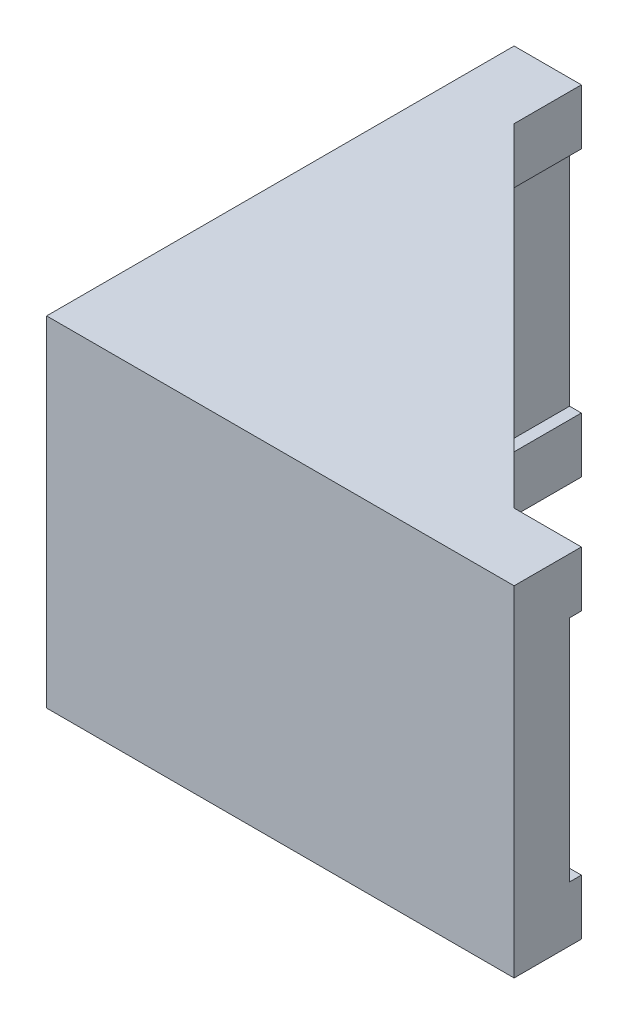
ISO-10303-21;
HEADER;
FILE_DESCRIPTION(('STEP AP214'),'2;1');
FILE_NAME('part.step','',(''),(''),'','','');
FILE_SCHEMA(('AUTOMOTIVE_DESIGN { 1 0 10303 214 1 1 1 1 }'));
ENDSEC;
DATA;
#1=APPLICATION_CONTEXT('core data for automotive mechanical design processes');
#2=APPLICATION_PROTOCOL_DEFINITION('international standard','automotive_design',2000,#1);
#3=PRODUCT_CONTEXT('',#1,'mechanical');
#4=PRODUCT('Part','Part','',(#3));
#5=PRODUCT_RELATED_PRODUCT_CATEGORY('part','',(#4));
#6=PRODUCT_DEFINITION_FORMATION('','',#4);
#7=PRODUCT_DEFINITION_CONTEXT('part definition',#1,'design');
#8=PRODUCT_DEFINITION('design','',#6,#7);
#9=PRODUCT_DEFINITION_SHAPE('','',#8);
#10=(LENGTH_UNIT() NAMED_UNIT(*) SI_UNIT(.MILLI.,.METRE.));
#11=(NAMED_UNIT(*) PLANE_ANGLE_UNIT() SI_UNIT($,.RADIAN.));
#12=(NAMED_UNIT(*) SI_UNIT($,.STERADIAN.) SOLID_ANGLE_UNIT());
#13=UNCERTAINTY_MEASURE_WITH_UNIT(LENGTH_MEASURE(1.E-05),#10,'distance_accuracy_value','');
#14=(GEOMETRIC_REPRESENTATION_CONTEXT(3) GLOBAL_UNCERTAINTY_ASSIGNED_CONTEXT((#13)) GLOBAL_UNIT_ASSIGNED_CONTEXT((#10,
#11,#12)) REPRESENTATION_CONTEXT('',''));
#15=CARTESIAN_POINT('',(0.,0.,0.));
#16=DIRECTION('',(0.,0.,1.));
#17=DIRECTION('',(1.,0.,0.));
#18=AXIS2_PLACEMENT_3D('',#15,#16,#17);
#19=CARTESIAN_POINT('',(0.,0.,0.));
#20=DIRECTION('',(0.,1.,0.));
#21=DIRECTION('',(0.,0.,1.));
#22=AXIS2_PLACEMENT_3D('',#19,#20,#21);
#23=PLANE('',#22);
#24=DIRECTION('',(1.,0.,0.));
#25=VECTOR('',#24,1.);
#26=CARTESIAN_POINT('',(3.3,0.,-3.3));
#27=LINE('',#26,#25);
#28=CARTESIAN_POINT('',(3.3,0.,-3.3));
#29=VERTEX_POINT('',#28);
#30=CARTESIAN_POINT('',(27.8,0.,-3.3));
#31=VERTEX_POINT('',#30);
#32=EDGE_CURVE('E197',#29,#31,#27,.T.);
#33=ORIENTED_EDGE('',*,*,#32,.F.);
#34=DIRECTION('',(0.,0.,1.));
#35=VECTOR('',#34,1.);
#36=CARTESIAN_POINT('',(3.3,0.,-3.3));
#37=LINE('',#36,#35);
#38=CARTESIAN_POINT('',(3.3,0.,-27.8));
#39=VERTEX_POINT('',#38);
#40=EDGE_CURVE('E58',#39,#29,#37,.T.);
#41=ORIENTED_EDGE('',*,*,#40,.F.);
#42=DIRECTION('',(-1.,0.,0.));
#43=VECTOR('',#42,1.);
#44=CARTESIAN_POINT('',(4.,0.,-27.8));
#45=LINE('',#44,#43);
#46=CARTESIAN_POINT('',(4.,0.,-27.8));
#47=VERTEX_POINT('',#46);
#48=EDGE_CURVE('E215',#47,#39,#45,.T.);
#49=ORIENTED_EDGE('',*,*,#48,.F.);
#50=DIRECTION('',(0.,0.,-1.));
#51=VECTOR('',#50,1.);
#52=CARTESIAN_POINT('',(4.,0.,-27.8));
#53=LINE('',#52,#51);
#54=CARTESIAN_POINT('',(4.,0.,-23.8));
#55=VERTEX_POINT('',#54);
#56=EDGE_CURVE('E232',#55,#47,#53,.T.);
#57=ORIENTED_EDGE('',*,*,#56,.F.);
#58=DIRECTION('',(-0.707106781186547,0.,-0.707106781186548));
#59=VECTOR('',#58,1.);
#60=CARTESIAN_POINT('',(4.,0.,-23.8));
#61=LINE('',#60,#59);
#62=CARTESIAN_POINT('',(23.8,0.,-4.));
#63=VERTEX_POINT('',#62);
#64=EDGE_CURVE('E230',#63,#55,#61,.T.);
#65=ORIENTED_EDGE('',*,*,#64,.F.);
#66=DIRECTION('',(-1.,0.,0.));
#67=VECTOR('',#66,1.);
#68=CARTESIAN_POINT('',(23.8,0.,-4.));
#69=LINE('',#68,#67);
#70=CARTESIAN_POINT('',(27.8,0.,-4.));
#71=VERTEX_POINT('',#70);
#72=EDGE_CURVE('E228',#71,#63,#69,.T.);
#73=ORIENTED_EDGE('',*,*,#72,.F.);
#74=DIRECTION('',(0.,0.,-1.));
#75=VECTOR('',#74,1.);
#76=CARTESIAN_POINT('',(27.8,0.,0.));
#77=LINE('',#76,#75);
#78=EDGE_CURVE('E52',#31,#71,#77,.T.);
#79=ORIENTED_EDGE('',*,*,#78,.F.);
#80=EDGE_LOOP('',(#33,#41,#49,#57,#65,#73,#79));
#81=FACE_BOUND('',#80,.T.);
#82=ADVANCED_FACE('F37',(#81),#23,.F.);
#83=CARTESIAN_POINT('',(0.,3.3,-27.8));
#84=DIRECTION('',(1.,0.,0.));
#85=DIRECTION('',(0.,0.,-1.));
#86=AXIS2_PLACEMENT_3D('',#83,#84,#85);
#87=PLANE('',#86);
#88=DIRECTION('',(0.,-1.,0.));
#89=VECTOR('',#88,1.);
#90=CARTESIAN_POINT('',(0.,3.3,-27.8));
#91=LINE('',#90,#89);
#92=CARTESIAN_POINT('',(0.,3.3,-27.8));
#93=VERTEX_POINT('',#92);
#94=CARTESIAN_POINT('',(0.,-16.9,-27.8));
#95=VERTEX_POINT('',#94);
#96=EDGE_CURVE('E226',#93,#95,#91,.T.);
#97=ORIENTED_EDGE('',*,*,#96,.T.);
#98=DIRECTION('',(0.,0.,-1.));
#99=VECTOR('',#98,1.);
#100=CARTESIAN_POINT('',(0.,-16.9,0.));
#101=LINE('',#100,#99);
#102=CARTESIAN_POINT('',(0.,-16.9,0.));
#103=VERTEX_POINT('',#102);
#104=EDGE_CURVE('E160',#103,#95,#101,.T.);
#105=ORIENTED_EDGE('',*,*,#104,.F.);
#106=DIRECTION('',(0.,-1.,0.));
#107=VECTOR('',#106,1.);
#108=CARTESIAN_POINT('',(0.,3.3,0.));
#109=LINE('',#108,#107);
#110=CARTESIAN_POINT('',(0.,3.3,0.));
#111=VERTEX_POINT('',#110);
#112=EDGE_CURVE('E11',#111,#103,#109,.T.);
#113=ORIENTED_EDGE('',*,*,#112,.F.);
#114=DIRECTION('',(0.,0.,1.));
#115=VECTOR('',#114,1.);
#116=CARTESIAN_POINT('',(0.,3.3,-27.8));
#117=LINE('',#116,#115);
#118=EDGE_CURVE('E211',#93,#111,#117,.T.);
#119=ORIENTED_EDGE('',*,*,#118,.F.);
#120=EDGE_LOOP('',(#97,#105,#113,#119));
#121=FACE_BOUND('',#120,.T.);
#122=ADVANCED_FACE('F39',(#121),#87,.F.);
#123=CARTESIAN_POINT('',(0.,3.3,0.));
#124=DIRECTION('',(0.,0.,-1.));
#125=DIRECTION('',(-1.,0.,0.));
#126=AXIS2_PLACEMENT_3D('',#123,#124,#125);
#127=PLANE('',#126);
#128=ORIENTED_EDGE('',*,*,#112,.T.);
#129=DIRECTION('',(-1.,0.,0.));
#130=VECTOR('',#129,1.);
#131=CARTESIAN_POINT('',(27.8,-16.9,0.));
#132=LINE('',#131,#130);
#133=CARTESIAN_POINT('',(27.8,-16.9,0.));
#134=VERTEX_POINT('',#133);
#135=EDGE_CURVE('E151',#134,#103,#132,.T.);
#136=ORIENTED_EDGE('',*,*,#135,.F.);
#137=DIRECTION('',(0.,-1.,0.));
#138=VECTOR('',#137,1.);
#139=CARTESIAN_POINT('',(27.8,3.3,0.));
#140=LINE('',#139,#138);
#141=CARTESIAN_POINT('',(27.8,3.3,0.));
#142=VERTEX_POINT('',#141);
#143=EDGE_CURVE('E45',#142,#134,#140,.T.);
#144=ORIENTED_EDGE('',*,*,#143,.F.);
#145=DIRECTION('',(1.,0.,0.));
#146=VECTOR('',#145,1.);
#147=CARTESIAN_POINT('',(0.,3.3,0.));
#148=LINE('',#147,#146);
#149=EDGE_CURVE('E214',#111,#142,#148,.T.);
#150=ORIENTED_EDGE('',*,*,#149,.F.);
#151=EDGE_LOOP('',(#128,#136,#144,#150));
#152=FACE_BOUND('',#151,.T.);
#153=ADVANCED_FACE('F158',(#152),#127,.F.);
#154=CARTESIAN_POINT('',(27.8,3.3,0.));
#155=DIRECTION('',(-1.,0.,0.));
#156=DIRECTION('',(0.,0.,1.));
#157=AXIS2_PLACEMENT_3D('',#154,#155,#156);
#158=PLANE('',#157);
#159=ORIENTED_EDGE('',*,*,#143,.T.);
#160=DIRECTION('',(0.,0.,1.));
#161=VECTOR('',#160,1.);
#162=CARTESIAN_POINT('',(27.8,-16.9,-3.3));
#163=LINE('',#162,#161);
#164=CARTESIAN_POINT('',(27.8,-16.9,-4.));
#165=VERTEX_POINT('',#164);
#166=EDGE_CURVE('E141',#165,#134,#163,.T.);
#167=ORIENTED_EDGE('',*,*,#166,.F.);
#168=DIRECTION('',(0.,1.,0.));
#169=VECTOR('',#168,1.);
#170=CARTESIAN_POINT('',(27.8,-16.9,-4.));
#171=LINE('',#170,#169);
#172=CARTESIAN_POINT('',(27.8,-13.6,-4.));
#173=VERTEX_POINT('',#172);
#174=EDGE_CURVE('E171',#165,#173,#171,.T.);
#175=ORIENTED_EDGE('',*,*,#174,.T.);
#176=DIRECTION('',(0.,0.,1.));
#177=VECTOR('',#176,1.);
#178=CARTESIAN_POINT('',(27.8,-13.6,-3.3));
#179=LINE('',#178,#177);
#180=CARTESIAN_POINT('',(27.8,-13.6,-3.3));
#181=VERTEX_POINT('',#180);
#182=EDGE_CURVE('E172',#173,#181,#179,.T.);
#183=ORIENTED_EDGE('',*,*,#182,.T.);
#184=DIRECTION('',(0.,1.,0.));
#185=VECTOR('',#184,1.);
#186=CARTESIAN_POINT('',(27.8,-13.6,-3.3));
#187=LINE('',#186,#185);
#188=EDGE_CURVE('E200',#181,#31,#187,.T.);
#189=ORIENTED_EDGE('',*,*,#188,.T.);
#190=ORIENTED_EDGE('',*,*,#78,.T.);
#191=DIRECTION('',(0.,-1.,0.));
#192=VECTOR('',#191,1.);
#193=CARTESIAN_POINT('',(27.8,3.3,-4.));
#194=LINE('',#193,#192);
#195=CARTESIAN_POINT('',(27.8,3.3,-4.));
#196=VERTEX_POINT('',#195);
#197=EDGE_CURVE('E146',#196,#71,#194,.T.);
#198=ORIENTED_EDGE('',*,*,#197,.F.);
#199=DIRECTION('',(0.,0.,-1.));
#200=VECTOR('',#199,1.);
#201=CARTESIAN_POINT('',(27.8,3.3,0.));
#202=LINE('',#201,#200);
#203=EDGE_CURVE('E143',#142,#196,#202,.T.);
#204=ORIENTED_EDGE('',*,*,#203,.F.);
#205=EDGE_LOOP('',(#159,#167,#175,#183,#189,#190,#198,#204));
#206=FACE_BOUND('',#205,.T.);
#207=ADVANCED_FACE('F139',(#206),#158,.F.);
#208=CARTESIAN_POINT('',(23.8,3.3,-4.));
#209=DIRECTION('',(0.,0.,1.));
#210=DIRECTION('',(1.,0.,0.));
#211=AXIS2_PLACEMENT_3D('',#208,#209,#210);
#212=PLANE('',#211);
#213=ORIENTED_EDGE('',*,*,#72,.T.);
#214=DIRECTION('',(0.,-1.,0.));
#215=VECTOR('',#214,1.);
#216=CARTESIAN_POINT('',(23.8,3.3,-4.));
#217=LINE('',#216,#215);
#218=CARTESIAN_POINT('',(23.8,3.3,-4.));
#219=VERTEX_POINT('',#218);
#220=EDGE_CURVE('E242',#219,#63,#217,.T.);
#221=ORIENTED_EDGE('',*,*,#220,.F.);
#222=DIRECTION('',(-1.,0.,0.));
#223=VECTOR('',#222,1.);
#224=CARTESIAN_POINT('',(23.8,3.3,-4.));
#225=LINE('',#224,#223);
#226=EDGE_CURVE('E218',#196,#219,#225,.T.);
#227=ORIENTED_EDGE('',*,*,#226,.F.);
#228=ORIENTED_EDGE('',*,*,#197,.T.);
#229=EDGE_LOOP('',(#213,#221,#227,#228));
#230=FACE_BOUND('',#229,.T.);
#231=ADVANCED_FACE('F248',(#230),#212,.F.);
#232=CARTESIAN_POINT('',(4.,3.3,-23.8));
#233=DIRECTION('',(-0.707106781186548,0.,0.707106781186547));
#234=DIRECTION('',(0.707106781186547,0.,0.707106781186548));
#235=AXIS2_PLACEMENT_3D('',#232,#233,#234);
#236=PLANE('',#235);
#237=ORIENTED_EDGE('',*,*,#64,.T.);
#238=DIRECTION('',(0.,-1.,0.));
#239=VECTOR('',#238,1.);
#240=CARTESIAN_POINT('',(4.,3.3,-23.8));
#241=LINE('',#240,#239);
#242=CARTESIAN_POINT('',(4.,3.3,-23.8));
#243=VERTEX_POINT('',#242);
#244=EDGE_CURVE('E239',#243,#55,#241,.T.);
#245=ORIENTED_EDGE('',*,*,#244,.F.);
#246=DIRECTION('',(-0.707106781186547,0.,-0.707106781186548));
#247=VECTOR('',#246,1.);
#248=CARTESIAN_POINT('',(4.,3.3,-23.8));
#249=LINE('',#248,#247);
#250=EDGE_CURVE('E220',#219,#243,#249,.T.);
#251=ORIENTED_EDGE('',*,*,#250,.F.);
#252=ORIENTED_EDGE('',*,*,#220,.T.);
#253=EDGE_LOOP('',(#237,#245,#251,#252));
#254=FACE_BOUND('',#253,.T.);
#255=ADVANCED_FACE('F254',(#254),#236,.F.);
#256=CARTESIAN_POINT('',(4.,3.3,-27.8));
#257=DIRECTION('',(-1.,0.,0.));
#258=DIRECTION('',(0.,0.,1.));
#259=AXIS2_PLACEMENT_3D('',#256,#257,#258);
#260=PLANE('',#259);
#261=ORIENTED_EDGE('',*,*,#56,.T.);
#262=DIRECTION('',(0.,-1.,0.));
#263=VECTOR('',#262,1.);
#264=CARTESIAN_POINT('',(4.,3.3,-27.8));
#265=LINE('',#264,#263);
#266=CARTESIAN_POINT('',(4.,3.3,-27.8));
#267=VERTEX_POINT('',#266);
#268=EDGE_CURVE('E236',#267,#47,#265,.T.);
#269=ORIENTED_EDGE('',*,*,#268,.F.);
#270=DIRECTION('',(0.,0.,-1.));
#271=VECTOR('',#270,1.);
#272=CARTESIAN_POINT('',(4.,3.3,-27.8));
#273=LINE('',#272,#271);
#274=EDGE_CURVE('E222',#243,#267,#273,.T.);
#275=ORIENTED_EDGE('',*,*,#274,.F.);
#276=ORIENTED_EDGE('',*,*,#244,.T.);
#277=EDGE_LOOP('',(#261,#269,#275,#276));
#278=FACE_BOUND('',#277,.T.);
#279=ADVANCED_FACE('F258',(#278),#260,.F.);
#280=CARTESIAN_POINT('',(4.,3.3,-27.8));
#281=DIRECTION('',(0.,0.,1.));
#282=DIRECTION('',(1.,0.,0.));
#283=AXIS2_PLACEMENT_3D('',#280,#281,#282);
#284=PLANE('',#283);
#285=ORIENTED_EDGE('',*,*,#48,.T.);
#286=DIRECTION('',(0.,1.,0.));
#287=VECTOR('',#286,1.);
#288=CARTESIAN_POINT('',(3.3,-13.6,-27.8));
#289=LINE('',#288,#287);
#290=CARTESIAN_POINT('',(3.3,-13.6,-27.8));
#291=VERTEX_POINT('',#290);
#292=EDGE_CURVE('E208',#291,#39,#289,.T.);
#293=ORIENTED_EDGE('',*,*,#292,.F.);
#294=DIRECTION('',(1.,0.,0.));
#295=VECTOR('',#294,1.);
#296=CARTESIAN_POINT('',(4.,-13.6,-27.8));
#297=LINE('',#296,#295);
#298=CARTESIAN_POINT('',(4.,-13.6,-27.8));
#299=VERTEX_POINT('',#298);
#300=EDGE_CURVE('E175',#291,#299,#297,.T.);
#301=ORIENTED_EDGE('',*,*,#300,.T.);
#302=DIRECTION('',(0.,1.,0.));
#303=VECTOR('',#302,1.);
#304=CARTESIAN_POINT('',(4.,-16.9,-27.8));
#305=LINE('',#304,#303);
#306=CARTESIAN_POINT('',(4.,-16.9,-27.8));
#307=VERTEX_POINT('',#306);
#308=EDGE_CURVE('E190',#307,#299,#305,.T.);
#309=ORIENTED_EDGE('',*,*,#308,.F.);
#310=DIRECTION('',(1.,0.,0.));
#311=VECTOR('',#310,1.);
#312=CARTESIAN_POINT('',(0.,-16.9,-27.8));
#313=LINE('',#312,#311);
#314=EDGE_CURVE('E162',#95,#307,#313,.T.);
#315=ORIENTED_EDGE('',*,*,#314,.F.);
#316=ORIENTED_EDGE('',*,*,#96,.F.);
#317=DIRECTION('',(-1.,0.,0.));
#318=VECTOR('',#317,1.);
#319=CARTESIAN_POINT('',(4.,3.3,-27.8));
#320=LINE('',#319,#318);
#321=EDGE_CURVE('E224',#267,#93,#320,.T.);
#322=ORIENTED_EDGE('',*,*,#321,.F.);
#323=ORIENTED_EDGE('',*,*,#268,.T.);
#324=EDGE_LOOP('',(#285,#293,#301,#309,#315,#316,#322,#323));
#325=FACE_BOUND('',#324,.T.);
#326=ADVANCED_FACE('F269',(#325),#284,.F.);
#327=CARTESIAN_POINT('',(0.,3.3,0.));
#328=DIRECTION('',(0.,1.,0.));
#329=DIRECTION('',(0.,0.,1.));
#330=AXIS2_PLACEMENT_3D('',#327,#328,#329);
#331=PLANE('',#330);
#332=ORIENTED_EDGE('',*,*,#118,.T.);
#333=ORIENTED_EDGE('',*,*,#149,.T.);
#334=ORIENTED_EDGE('',*,*,#203,.T.);
#335=ORIENTED_EDGE('',*,*,#226,.T.);
#336=ORIENTED_EDGE('',*,*,#250,.T.);
#337=ORIENTED_EDGE('',*,*,#274,.T.);
#338=ORIENTED_EDGE('',*,*,#321,.T.);
#339=EDGE_LOOP('',(#332,#333,#334,#335,#336,#337,#338));
#340=FACE_BOUND('',#339,.T.);
#341=ADVANCED_FACE('F262',(#340),#331,.T.);
#342=CARTESIAN_POINT('',(3.3,-13.6,-3.3));
#343=DIRECTION('',(-1.,0.,0.));
#344=DIRECTION('',(0.,0.,1.));
#345=AXIS2_PLACEMENT_3D('',#342,#343,#344);
#346=PLANE('',#345);
#347=ORIENTED_EDGE('',*,*,#40,.T.);
#348=DIRECTION('',(0.,1.,0.));
#349=VECTOR('',#348,1.);
#350=CARTESIAN_POINT('',(3.3,-13.6,-3.3));
#351=LINE('',#350,#349);
#352=CARTESIAN_POINT('',(3.3,-13.6,-3.3));
#353=VERTEX_POINT('',#352);
#354=EDGE_CURVE('E205',#353,#29,#351,.T.);
#355=ORIENTED_EDGE('',*,*,#354,.F.);
#356=DIRECTION('',(0.,0.,1.));
#357=VECTOR('',#356,1.);
#358=CARTESIAN_POINT('',(3.3,-13.6,-3.3));
#359=LINE('',#358,#357);
#360=EDGE_CURVE('E193',#291,#353,#359,.T.);
#361=ORIENTED_EDGE('',*,*,#360,.F.);
#362=ORIENTED_EDGE('',*,*,#292,.T.);
#363=EDGE_LOOP('',(#347,#355,#361,#362));
#364=FACE_BOUND('',#363,.T.);
#365=ADVANCED_FACE('F291',(#364),#346,.F.);
#366=CARTESIAN_POINT('',(3.3,-13.6,-3.3));
#367=DIRECTION('',(0.,0.,1.));
#368=DIRECTION('',(1.,0.,0.));
#369=AXIS2_PLACEMENT_3D('',#366,#367,#368);
#370=PLANE('',#369);
#371=ORIENTED_EDGE('',*,*,#32,.T.);
#372=ORIENTED_EDGE('',*,*,#188,.F.);
#373=DIRECTION('',(1.,0.,0.));
#374=VECTOR('',#373,1.);
#375=CARTESIAN_POINT('',(3.3,-13.6,-3.3));
#376=LINE('',#375,#374);
#377=EDGE_CURVE('E196',#353,#181,#376,.T.);
#378=ORIENTED_EDGE('',*,*,#377,.F.);
#379=ORIENTED_EDGE('',*,*,#354,.T.);
#380=EDGE_LOOP('',(#371,#372,#378,#379));
#381=FACE_BOUND('',#380,.T.);
#382=ADVANCED_FACE('F289',(#381),#370,.F.);
#383=CARTESIAN_POINT('',(4.,-16.9,-23.8));
#384=DIRECTION('',(-1.,0.,0.));
#385=DIRECTION('',(0.,0.,1.));
#386=AXIS2_PLACEMENT_3D('',#383,#384,#385);
#387=PLANE('',#386);
#388=DIRECTION('',(0.,0.,1.));
#389=VECTOR('',#388,1.);
#390=CARTESIAN_POINT('',(4.,-13.6,-23.8));
#391=LINE('',#390,#389);
#392=CARTESIAN_POINT('',(4.,-13.6,-23.8));
#393=VERTEX_POINT('',#392);
#394=EDGE_CURVE('E177',#299,#393,#391,.T.);
#395=ORIENTED_EDGE('',*,*,#394,.T.);
#396=DIRECTION('',(0.,1.,0.));
#397=VECTOR('',#396,1.);
#398=CARTESIAN_POINT('',(4.,-16.9,-23.8));
#399=LINE('',#398,#397);
#400=CARTESIAN_POINT('',(4.,-16.9,-23.8));
#401=VERTEX_POINT('',#400);
#402=EDGE_CURVE('E187',#401,#393,#399,.T.);
#403=ORIENTED_EDGE('',*,*,#402,.F.);
#404=DIRECTION('',(0.,0.,1.));
#405=VECTOR('',#404,1.);
#406=CARTESIAN_POINT('',(4.,-16.9,-23.8));
#407=LINE('',#406,#405);
#408=EDGE_CURVE('E166',#307,#401,#407,.T.);
#409=ORIENTED_EDGE('',*,*,#408,.F.);
#410=ORIENTED_EDGE('',*,*,#308,.T.);
#411=EDGE_LOOP('',(#395,#403,#409,#410));
#412=FACE_BOUND('',#411,.T.);
#413=ADVANCED_FACE('F275',(#412),#387,.F.);
#414=CARTESIAN_POINT('',(23.8,-16.9,-4.));
#415=DIRECTION('',(-0.707106781186548,0.,0.707106781186547));
#416=DIRECTION('',(0.707106781186547,0.,0.707106781186548));
#417=AXIS2_PLACEMENT_3D('',#414,#415,#416);
#418=PLANE('',#417);
#419=DIRECTION('',(0.707106781186547,0.,0.707106781186548));
#420=VECTOR('',#419,1.);
#421=CARTESIAN_POINT('',(23.8,-13.6,-4.));
#422=LINE('',#421,#420);
#423=CARTESIAN_POINT('',(23.8,-13.6,-4.));
#424=VERTEX_POINT('',#423);
#425=EDGE_CURVE('E179',#393,#424,#422,.T.);
#426=ORIENTED_EDGE('',*,*,#425,.T.);
#427=DIRECTION('',(0.,1.,0.));
#428=VECTOR('',#427,1.);
#429=CARTESIAN_POINT('',(23.8,-16.9,-4.));
#430=LINE('',#429,#428);
#431=CARTESIAN_POINT('',(23.8,-16.9,-4.));
#432=VERTEX_POINT('',#431);
#433=EDGE_CURVE('E184',#432,#424,#430,.T.);
#434=ORIENTED_EDGE('',*,*,#433,.F.);
#435=DIRECTION('',(0.707106781186547,0.,0.707106781186548));
#436=VECTOR('',#435,1.);
#437=CARTESIAN_POINT('',(23.8,-16.9,-4.));
#438=LINE('',#437,#436);
#439=EDGE_CURVE('E168',#401,#432,#438,.T.);
#440=ORIENTED_EDGE('',*,*,#439,.F.);
#441=ORIENTED_EDGE('',*,*,#402,.T.);
#442=EDGE_LOOP('',(#426,#434,#440,#441));
#443=FACE_BOUND('',#442,.T.);
#444=ADVANCED_FACE('F279',(#443),#418,.F.);
#445=CARTESIAN_POINT('',(27.8,-16.9,-4.));
#446=DIRECTION('',(0.,0.,1.));
#447=DIRECTION('',(1.,0.,0.));
#448=AXIS2_PLACEMENT_3D('',#445,#446,#447);
#449=PLANE('',#448);
#450=DIRECTION('',(1.,0.,0.));
#451=VECTOR('',#450,1.);
#452=CARTESIAN_POINT('',(27.8,-13.6,-4.));
#453=LINE('',#452,#451);
#454=EDGE_CURVE('E156',#424,#173,#453,.T.);
#455=ORIENTED_EDGE('',*,*,#454,.T.);
#456=ORIENTED_EDGE('',*,*,#174,.F.);
#457=DIRECTION('',(1.,0.,0.));
#458=VECTOR('',#457,1.);
#459=CARTESIAN_POINT('',(27.8,-16.9,-4.));
#460=LINE('',#459,#458);
#461=EDGE_CURVE('E154',#432,#165,#460,.T.);
#462=ORIENTED_EDGE('',*,*,#461,.F.);
#463=ORIENTED_EDGE('',*,*,#433,.T.);
#464=EDGE_LOOP('',(#455,#456,#462,#463));
#465=FACE_BOUND('',#464,.T.);
#466=ADVANCED_FACE('F283',(#465),#449,.F.);
#467=CARTESIAN_POINT('',(0.,-16.9,0.));
#468=DIRECTION('',(0.,1.,0.));
#469=DIRECTION('',(0.,0.,1.));
#470=AXIS2_PLACEMENT_3D('',#467,#468,#469);
#471=PLANE('',#470);
#472=ORIENTED_EDGE('',*,*,#166,.T.);
#473=ORIENTED_EDGE('',*,*,#135,.T.);
#474=ORIENTED_EDGE('',*,*,#104,.T.);
#475=ORIENTED_EDGE('',*,*,#314,.T.);
#476=ORIENTED_EDGE('',*,*,#408,.T.);
#477=ORIENTED_EDGE('',*,*,#439,.T.);
#478=ORIENTED_EDGE('',*,*,#461,.T.);
#479=EDGE_LOOP('',(#472,#473,#474,#475,#476,#477,#478));
#480=FACE_BOUND('',#479,.T.);
#481=ADVANCED_FACE('F149',(#480),#471,.F.);
#482=CARTESIAN_POINT('',(0.,-13.6,0.));
#483=DIRECTION('',(0.,1.,0.));
#484=DIRECTION('',(0.,0.,1.));
#485=AXIS2_PLACEMENT_3D('',#482,#483,#484);
#486=PLANE('',#485);
#487=ORIENTED_EDGE('',*,*,#300,.F.);
#488=ORIENTED_EDGE('',*,*,#360,.T.);
#489=ORIENTED_EDGE('',*,*,#377,.T.);
#490=ORIENTED_EDGE('',*,*,#182,.F.);
#491=ORIENTED_EDGE('',*,*,#454,.F.);
#492=ORIENTED_EDGE('',*,*,#425,.F.);
#493=ORIENTED_EDGE('',*,*,#394,.F.);
#494=EDGE_LOOP('',(#487,#488,#489,#490,#491,#492,#493));
#495=FACE_BOUND('',#494,.T.);
#496=ADVANCED_FACE('F285',(#495),#486,.T.);
#497=CLOSED_SHELL('',(#82,#122,#153,#207,#231,#255,#279,#326,#341,#365,#382,#413,#444,#466,#481,#496));
#498=MANIFOLD_SOLID_BREP('B2',#497);
#499=ADVANCED_BREP_SHAPE_REPRESENTATION('',(#18,#498),#14);
#500=SHAPE_DEFINITION_REPRESENTATION(#9,#499);
ENDSEC;
END-ISO-10303-21;
